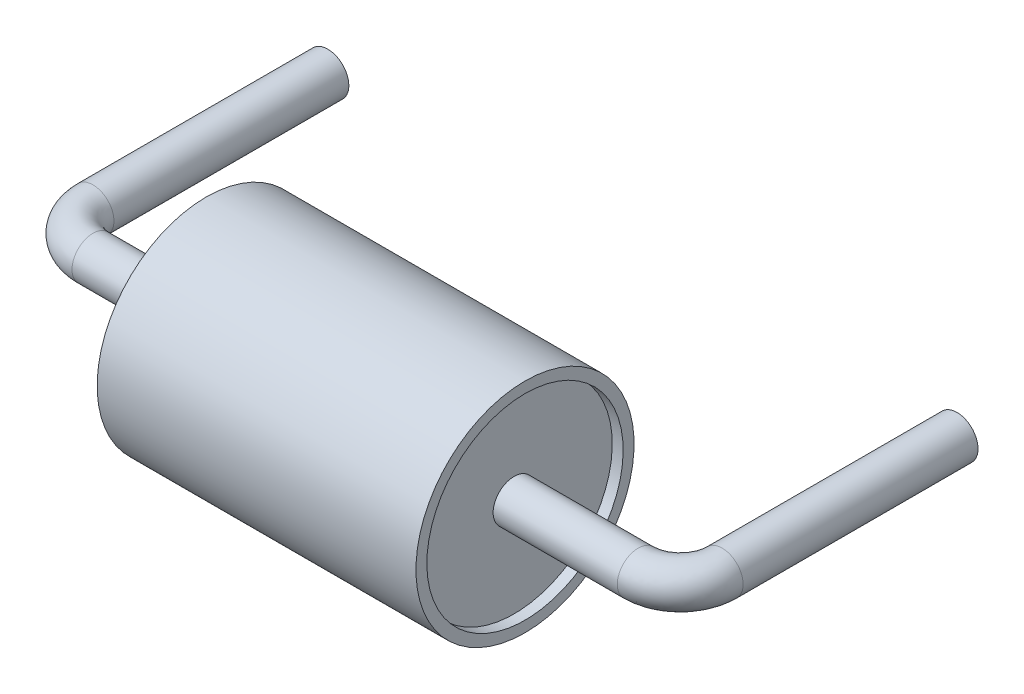
ISO-10303-21;
HEADER;
FILE_DESCRIPTION(('STEP AP214'),'2;1');
FILE_NAME('part.step','',(''),(''),'','','');
FILE_SCHEMA(('AUTOMOTIVE_DESIGN { 1 0 10303 214 1 1 1 1 }'));
ENDSEC;
DATA;
#1=APPLICATION_CONTEXT('core data for automotive mechanical design processes');
#2=APPLICATION_PROTOCOL_DEFINITION('international standard','automotive_design',2000,#1);
#3=PRODUCT_CONTEXT('',#1,'mechanical');
#4=PRODUCT('Part','Part','',(#3));
#5=PRODUCT_RELATED_PRODUCT_CATEGORY('part','',(#4));
#6=PRODUCT_DEFINITION_FORMATION('','',#4);
#7=PRODUCT_DEFINITION_CONTEXT('part definition',#1,'design');
#8=PRODUCT_DEFINITION('design','',#6,#7);
#9=PRODUCT_DEFINITION_SHAPE('','',#8);
#10=(LENGTH_UNIT() NAMED_UNIT(*) SI_UNIT(.MILLI.,.METRE.));
#11=(NAMED_UNIT(*) PLANE_ANGLE_UNIT() SI_UNIT($,.RADIAN.));
#12=(NAMED_UNIT(*) SI_UNIT($,.STERADIAN.) SOLID_ANGLE_UNIT());
#13=UNCERTAINTY_MEASURE_WITH_UNIT(LENGTH_MEASURE(1.E-05),#10,'distance_accuracy_value','');
#14=(GEOMETRIC_REPRESENTATION_CONTEXT(3) GLOBAL_UNCERTAINTY_ASSIGNED_CONTEXT((#13)) GLOBAL_UNIT_ASSIGNED_CONTEXT((#10,
#11,#12)) REPRESENTATION_CONTEXT('',''));
#15=CARTESIAN_POINT('',(0.,0.,0.));
#16=DIRECTION('',(0.,0.,1.));
#17=DIRECTION('',(1.,0.,0.));
#18=AXIS2_PLACEMENT_3D('',#15,#16,#17);
#19=CARTESIAN_POINT('',(7.5,0.,-2.));
#20=DIRECTION('',(0.,0.,1.));
#21=DIRECTION('',(1.,0.,0.));
#22=AXIS2_PLACEMENT_3D('',#19,#20,#21);
#23=PLANE('',#22);
#24=CARTESIAN_POINT('',(7.5,0.,-2.));
#25=DIRECTION('',(0.,0.,1.));
#26=DIRECTION('',(0.,1.,0.));
#27=AXIS2_PLACEMENT_3D('',#24,#25,#26);
#28=CIRCLE('',#27,0.25);
#29=CARTESIAN_POINT('',(7.5,0.25,-2.));
#30=VERTEX_POINT('',#29);
#31=EDGE_CURVE('E11',#30,#30,#28,.T.);
#32=ORIENTED_EDGE('',*,*,#31,.F.);
#33=EDGE_LOOP('',(#32));
#34=FACE_BOUND('',#33,.T.);
#35=ADVANCED_FACE('F17',(#34),#23,.F.);
#36=CARTESIAN_POINT('',(0.,0.,-2.));
#37=DIRECTION('',(0.,0.,1.));
#38=DIRECTION('',(1.,0.,0.));
#39=AXIS2_PLACEMENT_3D('',#36,#37,#38);
#40=PLANE('',#39);
#41=CARTESIAN_POINT('',(0.,0.,-2.));
#42=DIRECTION('',(0.,0.,1.));
#43=DIRECTION('',(0.,-1.,0.));
#44=AXIS2_PLACEMENT_3D('',#41,#42,#43);
#45=CIRCLE('',#44,0.25);
#46=CARTESIAN_POINT('',(0.,-0.25,-2.));
#47=VERTEX_POINT('',#46);
#48=EDGE_CURVE('E102',#47,#47,#45,.T.);
#49=ORIENTED_EDGE('',*,*,#48,.F.);
#50=EDGE_LOOP('',(#49));
#51=FACE_BOUND('',#50,.T.);
#52=ADVANCED_FACE('F134',(#51),#40,.F.);
#53=CARTESIAN_POINT('',(7.5,0.,-2.));
#54=DIRECTION('',(0.,0.,-1.));
#55=DIRECTION('',(0.,1.,0.));
#56=AXIS2_PLACEMENT_3D('',#53,#54,#55);
#57=CYLINDRICAL_SURFACE('',#56,0.25);
#58=DIRECTION('',(0.,0.,1.));
#59=VECTOR('',#58,1.);
#60=CARTESIAN_POINT('',(7.5,0.25,-2.));
#61=LINE('',#60,#59);
#62=CARTESIAN_POINT('',(7.5,0.25,0.8));
#63=VERTEX_POINT('',#62);
#64=EDGE_CURVE('E30',#30,#63,#61,.T.);
#65=ORIENTED_EDGE('',*,*,#64,.T.);
#66=CARTESIAN_POINT('',(7.5,0.,0.8));
#67=DIRECTION('',(0.,0.,1.));
#68=DIRECTION('',(0.,1.,0.));
#69=AXIS2_PLACEMENT_3D('',#66,#67,#68);
#70=CIRCLE('',#69,0.25);
#71=EDGE_CURVE('E104',#63,#63,#70,.T.);
#72=ORIENTED_EDGE('',*,*,#71,.F.);
#73=ORIENTED_EDGE('',*,*,#64,.F.);
#74=ORIENTED_EDGE('',*,*,#31,.T.);
#75=EDGE_LOOP('',(#65,#72,#73,#74));
#76=FACE_BOUND('',#75,.T.);
#77=ADVANCED_FACE('F131',(#76),#57,.T.);
#78=CARTESIAN_POINT('',(0.,0.,-2.));
#79=DIRECTION('',(0.,0.,-1.));
#80=DIRECTION('',(0.,-1.,0.));
#81=AXIS2_PLACEMENT_3D('',#78,#79,#80);
#82=CYLINDRICAL_SURFACE('',#81,0.25);
#83=DIRECTION('',(0.,0.,1.));
#84=VECTOR('',#83,1.);
#85=CARTESIAN_POINT('',(0.,-0.25,-2.));
#86=LINE('',#85,#84);
#87=CARTESIAN_POINT('',(0.,-0.25,0.8));
#88=VERTEX_POINT('',#87);
#89=EDGE_CURVE('E98',#47,#88,#86,.T.);
#90=ORIENTED_EDGE('',*,*,#89,.T.);
#91=CARTESIAN_POINT('',(0.,0.,0.8));
#92=DIRECTION('',(0.,0.,1.));
#93=DIRECTION('',(0.,-1.,0.));
#94=AXIS2_PLACEMENT_3D('',#91,#92,#93);
#95=CIRCLE('',#94,0.25);
#96=EDGE_CURVE('E100',#88,#88,#95,.T.);
#97=ORIENTED_EDGE('',*,*,#96,.F.);
#98=ORIENTED_EDGE('',*,*,#89,.F.);
#99=ORIENTED_EDGE('',*,*,#48,.T.);
#100=EDGE_LOOP('',(#90,#97,#98,#99));
#101=FACE_BOUND('',#100,.T.);
#102=ADVANCED_FACE('F99',(#101),#82,.T.);
#103=CARTESIAN_POINT('',(7.5,0.25,0.8));
#104=CARTESIAN_POINT('',(7.,0.25,0.8));
#105=CARTESIAN_POINT('',(7.,-0.25,0.8));
#106=CARTESIAN_POINT('',(7.5,-0.25,0.8));
#107=CARTESIAN_POINT('',(7.99999999999999,-0.25,0.8));
#108=CARTESIAN_POINT('',(7.99999999999999,0.25,0.8));
#109=CARTESIAN_POINT('',(7.5,0.25,0.8));
#110=(BOUNDED_CURVE() B_SPLINE_CURVE(3,(#103,#104,#105,#106,#107,#108,#109),.UNSPECIFIED.,.T.,
.F.) B_SPLINE_CURVE_WITH_KNOTS((4,3,4),(0.,0.5,1.),
.UNSPECIFIED.) CURVE() GEOMETRIC_REPRESENTATION_ITEM() RATIONAL_B_SPLINE_CURVE((1.,
0.333333333333334,0.333333333333334,1.,0.333333333333334,0.333333333333334,1.)) REPRESENTATION_ITEM(''));
#111=CARTESIAN_POINT('',(7.,-6.5,0.8));
#112=DIRECTION('',(0.,1.,0.));
#113=AXIS1_PLACEMENT('',#111,#112);
#114=SURFACE_OF_REVOLUTION('',#110,#113);
#115=CARTESIAN_POINT('',(7.,0.,1.3));
#116=DIRECTION('',(1.,0.,0.));
#117=DIRECTION('',(0.,1.,0.));
#118=AXIS2_PLACEMENT_3D('',#115,#116,#117);
#119=CIRCLE('',#118,0.25);
#120=CARTESIAN_POINT('',(7.,0.25,1.3));
#121=VERTEX_POINT('',#120);
#122=EDGE_CURVE('E113',#121,#121,#119,.T.);
#123=ORIENTED_EDGE('',*,*,#122,.T.);
#124=CARTESIAN_POINT('',(7.,0.25,0.8));
#125=DIRECTION('',(0.,-1.,0.));
#126=DIRECTION('',(1.,0.,0.));
#127=AXIS2_PLACEMENT_3D('',#124,#125,#126);
#128=CIRCLE('',#127,0.5);
#129=EDGE_CURVE('E107',#63,#121,#128,.T.);
#130=ORIENTED_EDGE('',*,*,#129,.F.);
#131=ORIENTED_EDGE('',*,*,#71,.T.);
#132=ORIENTED_EDGE('',*,*,#129,.T.);
#133=EDGE_LOOP('',(#123,#130,#131,#132));
#134=FACE_BOUND('',#133,.T.);
#135=ADVANCED_FACE('F127',(#134),#114,.T.);
#136=CARTESIAN_POINT('',(0.,-0.25,0.8));
#137=CARTESIAN_POINT('',(0.499999999999999,-0.25,0.8));
#138=CARTESIAN_POINT('',(0.499999999999999,0.25,0.8));
#139=CARTESIAN_POINT('',(0.,0.25,0.8));
#140=CARTESIAN_POINT('',(-0.499999999999999,0.25,0.8));
#141=CARTESIAN_POINT('',(-0.499999999999999,-0.25,0.8));
#142=CARTESIAN_POINT('',(0.,-0.25,0.8));
#143=(BOUNDED_CURVE() B_SPLINE_CURVE(3,(#136,#137,#138,#139,#140,#141,#142),.UNSPECIFIED.,.T.,
.F.) B_SPLINE_CURVE_WITH_KNOTS((4,3,4),(0.,0.5,1.),
.UNSPECIFIED.) CURVE() GEOMETRIC_REPRESENTATION_ITEM() RATIONAL_B_SPLINE_CURVE((1.,
0.333333333333334,0.333333333333334,1.,0.333333333333334,0.333333333333334,1.)) REPRESENTATION_ITEM(''));
#144=CARTESIAN_POINT('',(0.5,6.5,0.8));
#145=DIRECTION('',(0.,-1.,0.));
#146=AXIS1_PLACEMENT('',#144,#145);
#147=SURFACE_OF_REVOLUTION('',#143,#146);
#148=CARTESIAN_POINT('',(0.5,0.,1.3));
#149=DIRECTION('',(1.,0.,0.));
#150=DIRECTION('',(0.,1.,0.));
#151=AXIS2_PLACEMENT_3D('',#148,#149,#150);
#152=CIRCLE('',#151,0.25);
#153=CARTESIAN_POINT('',(0.5,0.25,1.3));
#154=VERTEX_POINT('',#153);
#155=CARTESIAN_POINT('',(0.5,-0.25,1.3));
#156=VERTEX_POINT('',#155);
#157=EDGE_CURVE('E212',#154,#156,#152,.T.);
#158=ORIENTED_EDGE('',*,*,#157,.F.);
#159=CARTESIAN_POINT('',(0.5,0.,1.3));
#160=DIRECTION('',(1.,0.,0.));
#161=DIRECTION('',(0.,1.,0.));
#162=AXIS2_PLACEMENT_3D('',#159,#160,#161);
#163=CIRCLE('',#162,0.25);
#164=EDGE_CURVE('E70',#156,#154,#163,.T.);
#165=ORIENTED_EDGE('',*,*,#164,.F.);
#166=CARTESIAN_POINT('',(0.5,-0.25,0.8));
#167=DIRECTION('',(0.,1.,0.));
#168=DIRECTION('',(-1.,0.,0.));
#169=AXIS2_PLACEMENT_3D('',#166,#167,#168);
#170=CIRCLE('',#169,0.5);
#171=EDGE_CURVE('E82',#88,#156,#170,.T.);
#172=ORIENTED_EDGE('',*,*,#171,.F.);
#173=ORIENTED_EDGE('',*,*,#96,.T.);
#174=ORIENTED_EDGE('',*,*,#171,.T.);
#175=EDGE_LOOP('',(#158,#165,#172,#173,#174));
#176=FACE_BOUND('',#175,.T.);
#177=ADVANCED_FACE('F19',(#176),#147,.T.);
#178=CARTESIAN_POINT('',(0.5,0.,1.3));
#179=DIRECTION('',(-1.,0.,0.));
#180=DIRECTION('',(0.,1.,0.));
#181=AXIS2_PLACEMENT_3D('',#178,#179,#180);
#182=CYLINDRICAL_SURFACE('',#181,0.25);
#183=DIRECTION('',(1.,0.,0.));
#184=VECTOR('',#183,1.);
#185=CARTESIAN_POINT('',(0.5,0.25,1.3));
#186=LINE('',#185,#184);
#187=CARTESIAN_POINT('',(5.52,0.25,1.3));
#188=VERTEX_POINT('',#187);
#189=EDGE_CURVE('E211',#188,#121,#186,.T.);
#190=ORIENTED_EDGE('',*,*,#189,.T.);
#191=ORIENTED_EDGE('',*,*,#122,.F.);
#192=ORIENTED_EDGE('',*,*,#189,.F.);
#193=CARTESIAN_POINT('',(5.52,0.,1.3));
#194=DIRECTION('',(-1.,0.,0.));
#195=DIRECTION('',(0.,1.,0.));
#196=AXIS2_PLACEMENT_3D('',#193,#194,#195);
#197=CIRCLE('',#196,0.25);
#198=EDGE_CURVE('E228',#188,#188,#197,.T.);
#199=ORIENTED_EDGE('',*,*,#198,.F.);
#200=EDGE_LOOP('',(#190,#191,#192,#199));
#201=FACE_BOUND('',#200,.T.);
#202=ADVANCED_FACE('F137',(#201),#182,.T.);
#203=CARTESIAN_POINT('',(0.5,0.,1.3));
#204=DIRECTION('',(-1.,0.,0.));
#205=DIRECTION('',(0.,1.,0.));
#206=AXIS2_PLACEMENT_3D('',#203,#204,#205);
#207=CYLINDRICAL_SURFACE('',#206,0.25);
#208=CARTESIAN_POINT('',(1.98,0.,1.3));
#209=DIRECTION('',(-1.,0.,0.));
#210=DIRECTION('',(0.,1.,0.));
#211=AXIS2_PLACEMENT_3D('',#208,#209,#210);
#212=CIRCLE('',#211,0.25);
#213=CARTESIAN_POINT('',(1.98,0.25,1.3));
#214=VERTEX_POINT('',#213);
#215=EDGE_CURVE('E232',#214,#214,#212,.T.);
#216=ORIENTED_EDGE('',*,*,#215,.T.);
#217=DIRECTION('',(1.,0.,0.));
#218=VECTOR('',#217,1.);
#219=CARTESIAN_POINT('',(0.5,0.25,1.3));
#220=LINE('',#219,#218);
#221=EDGE_CURVE('E227',#154,#214,#220,.T.);
#222=ORIENTED_EDGE('',*,*,#221,.F.);
#223=ORIENTED_EDGE('',*,*,#157,.T.);
#224=ORIENTED_EDGE('',*,*,#164,.T.);
#225=ORIENTED_EDGE('',*,*,#221,.T.);
#226=EDGE_LOOP('',(#216,#222,#223,#224,#225));
#227=FACE_BOUND('',#226,.T.);
#228=ADVANCED_FACE('F140',(#227),#207,.T.);
#229=CARTESIAN_POINT('',(5.52,0.,1.3));
#230=DIRECTION('',(1.,0.,0.));
#231=DIRECTION('',(0.,1.,0.));
#232=AXIS2_PLACEMENT_3D('',#229,#230,#231);
#233=PLANE('',#232);
#234=ORIENTED_EDGE('',*,*,#198,.T.);
#235=EDGE_LOOP('',(#234));
#236=FACE_BOUND('',#235,.T.);
#237=CARTESIAN_POINT('',(5.52,0.,1.3));
#238=DIRECTION('',(1.,0.,0.));
#239=DIRECTION('',(0.,1.,0.));
#240=AXIS2_PLACEMENT_3D('',#237,#238,#239);
#241=CIRCLE('',#240,1.17);
#242=CARTESIAN_POINT('',(5.52,1.17,1.3));
#243=VERTEX_POINT('',#242);
#244=EDGE_CURVE('E224',#243,#243,#241,.T.);
#245=ORIENTED_EDGE('',*,*,#244,.T.);
#246=EDGE_LOOP('',(#245));
#247=FACE_BOUND('',#246,.T.);
#248=ADVANCED_FACE('F147',(#236,#247),#233,.T.);
#249=CARTESIAN_POINT('',(1.98,0.,1.3));
#250=DIRECTION('',(1.,0.,0.));
#251=DIRECTION('',(0.,1.,0.));
#252=AXIS2_PLACEMENT_3D('',#249,#250,#251);
#253=PLANE('',#252);
#254=ORIENTED_EDGE('',*,*,#215,.F.);
#255=EDGE_LOOP('',(#254));
#256=FACE_BOUND('',#255,.T.);
#257=CARTESIAN_POINT('',(1.98,0.,1.3));
#258=DIRECTION('',(1.,0.,0.));
#259=DIRECTION('',(0.,1.,0.));
#260=AXIS2_PLACEMENT_3D('',#257,#258,#259);
#261=CIRCLE('',#260,1.17);
#262=CARTESIAN_POINT('',(1.98,1.17,1.3));
#263=VERTEX_POINT('',#262);
#264=EDGE_CURVE('E220',#263,#263,#261,.T.);
#265=ORIENTED_EDGE('',*,*,#264,.F.);
#266=EDGE_LOOP('',(#265));
#267=FACE_BOUND('',#266,.T.);
#268=ADVANCED_FACE('F153',(#256,#267),#253,.F.);
#269=CARTESIAN_POINT('',(1.85,0.,1.3));
#270=DIRECTION('',(-1.,0.,0.));
#271=DIRECTION('',(0.,1.,0.));
#272=AXIS2_PLACEMENT_3D('',#269,#270,#271);
#273=CYLINDRICAL_SURFACE('',#272,1.17);
#274=ORIENTED_EDGE('',*,*,#244,.F.);
#275=DIRECTION('',(1.,0.,0.));
#276=VECTOR('',#275,1.);
#277=CARTESIAN_POINT('',(1.85,1.17,1.3));
#278=LINE('',#277,#276);
#279=CARTESIAN_POINT('',(5.65,1.17,1.3));
#280=VERTEX_POINT('',#279);
#281=EDGE_CURVE('E236',#243,#280,#278,.T.);
#282=ORIENTED_EDGE('',*,*,#281,.T.);
#283=CARTESIAN_POINT('',(5.65,0.,1.3));
#284=DIRECTION('',(1.,0.,0.));
#285=DIRECTION('',(0.,1.,0.));
#286=AXIS2_PLACEMENT_3D('',#283,#284,#285);
#287=CIRCLE('',#286,1.17);
#288=EDGE_CURVE('E208',#280,#280,#287,.T.);
#289=ORIENTED_EDGE('',*,*,#288,.T.);
#290=ORIENTED_EDGE('',*,*,#281,.F.);
#291=EDGE_LOOP('',(#274,#282,#289,#290));
#292=FACE_BOUND('',#291,.T.);
#293=ADVANCED_FACE('F157',(#292),#273,.F.);
#294=CARTESIAN_POINT('',(1.85,0.,1.3));
#295=DIRECTION('',(-1.,0.,0.));
#296=DIRECTION('',(0.,1.,0.));
#297=AXIS2_PLACEMENT_3D('',#294,#295,#296);
#298=CYLINDRICAL_SURFACE('',#297,1.17);
#299=DIRECTION('',(1.,0.,0.));
#300=VECTOR('',#299,1.);
#301=CARTESIAN_POINT('',(1.85,1.17,1.3));
#302=LINE('',#301,#300);
#303=CARTESIAN_POINT('',(1.85,1.17,1.3));
#304=VERTEX_POINT('',#303);
#305=EDGE_CURVE('E216',#304,#263,#302,.T.);
#306=ORIENTED_EDGE('',*,*,#305,.F.);
#307=CARTESIAN_POINT('',(1.85,0.,1.3));
#308=DIRECTION('',(1.,0.,0.));
#309=DIRECTION('',(0.,1.,0.));
#310=AXIS2_PLACEMENT_3D('',#307,#308,#309);
#311=CIRCLE('',#310,1.17);
#312=EDGE_CURVE('E204',#304,#304,#311,.T.);
#313=ORIENTED_EDGE('',*,*,#312,.F.);
#314=ORIENTED_EDGE('',*,*,#305,.T.);
#315=ORIENTED_EDGE('',*,*,#264,.T.);
#316=EDGE_LOOP('',(#306,#313,#314,#315));
#317=FACE_BOUND('',#316,.T.);
#318=ADVANCED_FACE('F159',(#317),#298,.F.);
#319=CARTESIAN_POINT('',(5.65,0.,1.3));
#320=DIRECTION('',(1.,0.,0.));
#321=DIRECTION('',(0.,0.,1.));
#322=AXIS2_PLACEMENT_3D('',#319,#320,#321);
#323=PLANE('',#322);
#324=ORIENTED_EDGE('',*,*,#288,.F.);
#325=EDGE_LOOP('',(#324));
#326=FACE_BOUND('',#325,.T.);
#327=CARTESIAN_POINT('',(5.65,0.,1.3));
#328=DIRECTION('',(1.,0.,0.));
#329=DIRECTION('',(0.,1.,0.));
#330=AXIS2_PLACEMENT_3D('',#327,#328,#329);
#331=CIRCLE('',#330,1.3);
#332=CARTESIAN_POINT('',(5.65,1.3,1.3));
#333=VERTEX_POINT('',#332);
#334=EDGE_CURVE('E197',#333,#333,#331,.T.);
#335=ORIENTED_EDGE('',*,*,#334,.T.);
#336=EDGE_LOOP('',(#335));
#337=FACE_BOUND('',#336,.T.);
#338=ADVANCED_FACE('F162',(#326,#337),#323,.T.);
#339=CARTESIAN_POINT('',(1.85,0.,1.3));
#340=DIRECTION('',(1.,0.,0.));
#341=DIRECTION('',(0.,0.,1.));
#342=AXIS2_PLACEMENT_3D('',#339,#340,#341);
#343=PLANE('',#342);
#344=ORIENTED_EDGE('',*,*,#312,.T.);
#345=EDGE_LOOP('',(#344));
#346=FACE_BOUND('',#345,.T.);
#347=CARTESIAN_POINT('',(1.85,0.,1.3));
#348=DIRECTION('',(1.,0.,0.));
#349=DIRECTION('',(0.,1.,0.));
#350=AXIS2_PLACEMENT_3D('',#347,#348,#349);
#351=CIRCLE('',#350,1.3);
#352=CARTESIAN_POINT('',(1.85,1.3,1.3));
#353=VERTEX_POINT('',#352);
#354=EDGE_CURVE('E185',#353,#353,#351,.T.);
#355=ORIENTED_EDGE('',*,*,#354,.F.);
#356=EDGE_LOOP('',(#355));
#357=FACE_BOUND('',#356,.T.);
#358=ADVANCED_FACE('F169',(#346,#357),#343,.F.);
#359=CARTESIAN_POINT('',(1.85,0.,1.3));
#360=DIRECTION('',(-1.,0.,0.));
#361=DIRECTION('',(0.,1.,0.));
#362=AXIS2_PLACEMENT_3D('',#359,#360,#361);
#363=CYLINDRICAL_SURFACE('',#362,1.3);
#364=ORIENTED_EDGE('',*,*,#354,.T.);
#365=DIRECTION('',(1.,0.,0.));
#366=VECTOR('',#365,1.);
#367=CARTESIAN_POINT('',(1.85,1.3,1.3));
#368=LINE('',#367,#366);
#369=EDGE_CURVE('E188',#353,#333,#368,.T.);
#370=ORIENTED_EDGE('',*,*,#369,.T.);
#371=ORIENTED_EDGE('',*,*,#334,.F.);
#372=ORIENTED_EDGE('',*,*,#369,.F.);
#373=EDGE_LOOP('',(#364,#370,#371,#372));
#374=FACE_BOUND('',#373,.T.);
#375=ADVANCED_FACE('F173',(#374),#363,.T.);
#376=CLOSED_SHELL('',(#35,#52,#77,#102,#135,#177,#202,#228,#248,#268,#293,#318,#338,#358,#375));
#377=MANIFOLD_SOLID_BREP('B1',#376);
#378=ADVANCED_BREP_SHAPE_REPRESENTATION('',(#18,#377),#14);
#379=SHAPE_DEFINITION_REPRESENTATION(#9,#378);
ENDSEC;
END-ISO-10303-21;
